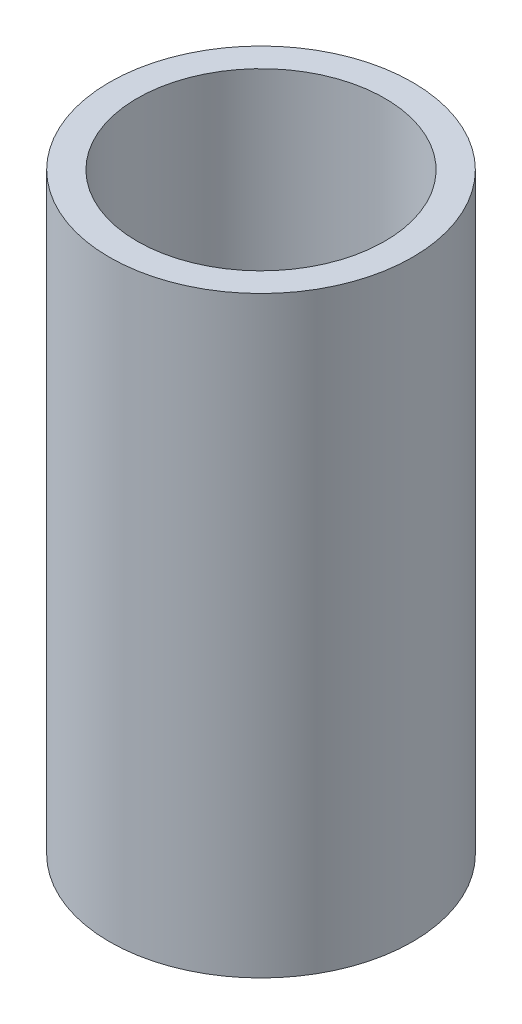
ISO-10303-21;
HEADER;
FILE_DESCRIPTION(('STEP AP214'),'2;1');
FILE_NAME('part.step','',(''),(''),'','','');
FILE_SCHEMA(('AUTOMOTIVE_DESIGN { 1 0 10303 214 1 1 1 1 }'));
ENDSEC;
DATA;
#1=APPLICATION_CONTEXT('core data for automotive mechanical design processes');
#2=APPLICATION_PROTOCOL_DEFINITION('international standard','automotive_design',2000,#1);
#3=PRODUCT_CONTEXT('',#1,'mechanical');
#4=PRODUCT('Part','Part','',(#3));
#5=PRODUCT_RELATED_PRODUCT_CATEGORY('part','',(#4));
#6=PRODUCT_DEFINITION_FORMATION('','',#4);
#7=PRODUCT_DEFINITION_CONTEXT('part definition',#1,'design');
#8=PRODUCT_DEFINITION('design','',#6,#7);
#9=PRODUCT_DEFINITION_SHAPE('','',#8);
#10=(LENGTH_UNIT() NAMED_UNIT(*) SI_UNIT(.MILLI.,.METRE.));
#11=(NAMED_UNIT(*) PLANE_ANGLE_UNIT() SI_UNIT($,.RADIAN.));
#12=(NAMED_UNIT(*) SI_UNIT($,.STERADIAN.) SOLID_ANGLE_UNIT());
#13=UNCERTAINTY_MEASURE_WITH_UNIT(LENGTH_MEASURE(1.E-05),#10,'distance_accuracy_value','');
#14=(GEOMETRIC_REPRESENTATION_CONTEXT(3) GLOBAL_UNCERTAINTY_ASSIGNED_CONTEXT((#13)) GLOBAL_UNIT_ASSIGNED_CONTEXT((#10,
#11,#12)) REPRESENTATION_CONTEXT('',''));
#15=CARTESIAN_POINT('',(0.,0.,0.));
#16=DIRECTION('',(0.,0.,1.));
#17=DIRECTION('',(1.,0.,0.));
#18=AXIS2_PLACEMENT_3D('',#15,#16,#17);
#19=CARTESIAN_POINT('',(0.,78.2166648518322,0.));
#20=DIRECTION('',(0.,-1.,0.));
#21=DIRECTION('',(0.,0.,-1.));
#22=AXIS2_PLACEMENT_3D('',#19,#20,#21);
#23=CYLINDRICAL_SURFACE('',#22,20.);
#24=CARTESIAN_POINT('',(0.,78.2166648518322,0.));
#25=DIRECTION('',(0.,1.,0.));
#26=DIRECTION('',(0.,0.,1.));
#27=AXIS2_PLACEMENT_3D('',#24,#25,#26);
#28=CIRCLE('',#27,20.);
#29=CARTESIAN_POINT('',(0.,78.2166648518322,20.));
#30=VERTEX_POINT('',#29);
#31=EDGE_CURVE('E10',#30,#30,#28,.T.);
#32=ORIENTED_EDGE('',*,*,#31,.F.);
#33=EDGE_LOOP('',(#32));
#34=FACE_BOUND('',#33,.T.);
#35=CARTESIAN_POINT('',(0.,0.,0.));
#36=DIRECTION('',(0.,1.,0.));
#37=DIRECTION('',(0.,0.,1.));
#38=AXIS2_PLACEMENT_3D('',#35,#36,#37);
#39=CIRCLE('',#38,20.);
#40=CARTESIAN_POINT('',(0.,0.,20.));
#41=VERTEX_POINT('',#40);
#42=EDGE_CURVE('E37',#41,#41,#39,.T.);
#43=ORIENTED_EDGE('',*,*,#42,.T.);
#44=EDGE_LOOP('',(#43));
#45=FACE_BOUND('',#44,.T.);
#46=ADVANCED_FACE('F40',(#34,#45),#23,.T.);
#47=CARTESIAN_POINT('',(0.,78.2166648518322,0.));
#48=DIRECTION('',(0.,1.,0.));
#49=DIRECTION('',(0.,0.,1.));
#50=AXIS2_PLACEMENT_3D('',#47,#48,#49);
#51=PLANE('',#50);
#52=CARTESIAN_POINT('',(0.,78.2166648518322,0.));
#53=DIRECTION('',(0.,1.,0.));
#54=DIRECTION('',(0.,0.,1.));
#55=AXIS2_PLACEMENT_3D('',#52,#53,#54);
#56=CIRCLE('',#55,16.3382163097058);
#57=CARTESIAN_POINT('',(0.,78.2166648518322,16.3382163097058));
#58=VERTEX_POINT('',#57);
#59=EDGE_CURVE('E50',#58,#58,#56,.T.);
#60=ORIENTED_EDGE('',*,*,#59,.F.);
#61=EDGE_LOOP('',(#60));
#62=FACE_BOUND('',#61,.T.);
#63=ORIENTED_EDGE('',*,*,#31,.T.);
#64=EDGE_LOOP('',(#63));
#65=FACE_BOUND('',#64,.T.);
#66=ADVANCED_FACE('F59',(#62,#65),#51,.T.);
#67=CARTESIAN_POINT('',(0.,0.,0.));
#68=DIRECTION('',(0.,1.,0.));
#69=DIRECTION('',(0.,0.,1.));
#70=AXIS2_PLACEMENT_3D('',#67,#68,#69);
#71=PLANE('',#70);
#72=CARTESIAN_POINT('',(0.,0.,0.));
#73=DIRECTION('',(0.,1.,0.));
#74=DIRECTION('',(0.,0.,1.));
#75=AXIS2_PLACEMENT_3D('',#72,#73,#74);
#76=CIRCLE('',#75,16.3382163097058);
#77=CARTESIAN_POINT('',(0.,0.,16.3382163097058));
#78=VERTEX_POINT('',#77);
#79=EDGE_CURVE('E47',#78,#78,#76,.T.);
#80=ORIENTED_EDGE('',*,*,#79,.T.);
#81=EDGE_LOOP('',(#80));
#82=FACE_BOUND('',#81,.T.);
#83=ORIENTED_EDGE('',*,*,#42,.F.);
#84=EDGE_LOOP('',(#83));
#85=FACE_BOUND('',#84,.T.);
#86=ADVANCED_FACE('F58',(#82,#85),#71,.F.);
#87=CARTESIAN_POINT('',(0.,78.2166648518322,0.));
#88=DIRECTION('',(0.,-1.,0.));
#89=DIRECTION('',(0.,0.,-1.));
#90=AXIS2_PLACEMENT_3D('',#87,#88,#89);
#91=CYLINDRICAL_SURFACE('',#90,16.3382163097058);
#92=ORIENTED_EDGE('',*,*,#59,.T.);
#93=EDGE_LOOP('',(#92));
#94=FACE_BOUND('',#93,.T.);
#95=ORIENTED_EDGE('',*,*,#79,.F.);
#96=EDGE_LOOP('',(#95));
#97=FACE_BOUND('',#96,.T.);
#98=ADVANCED_FACE('F54',(#94,#97),#91,.F.);
#99=CLOSED_SHELL('',(#46,#66,#86,#98));
#100=MANIFOLD_SOLID_BREP('B2',#99);
#101=ADVANCED_BREP_SHAPE_REPRESENTATION('',(#18,#100),#14);
#102=SHAPE_DEFINITION_REPRESENTATION(#9,#101);
ENDSEC;
END-ISO-10303-21;
